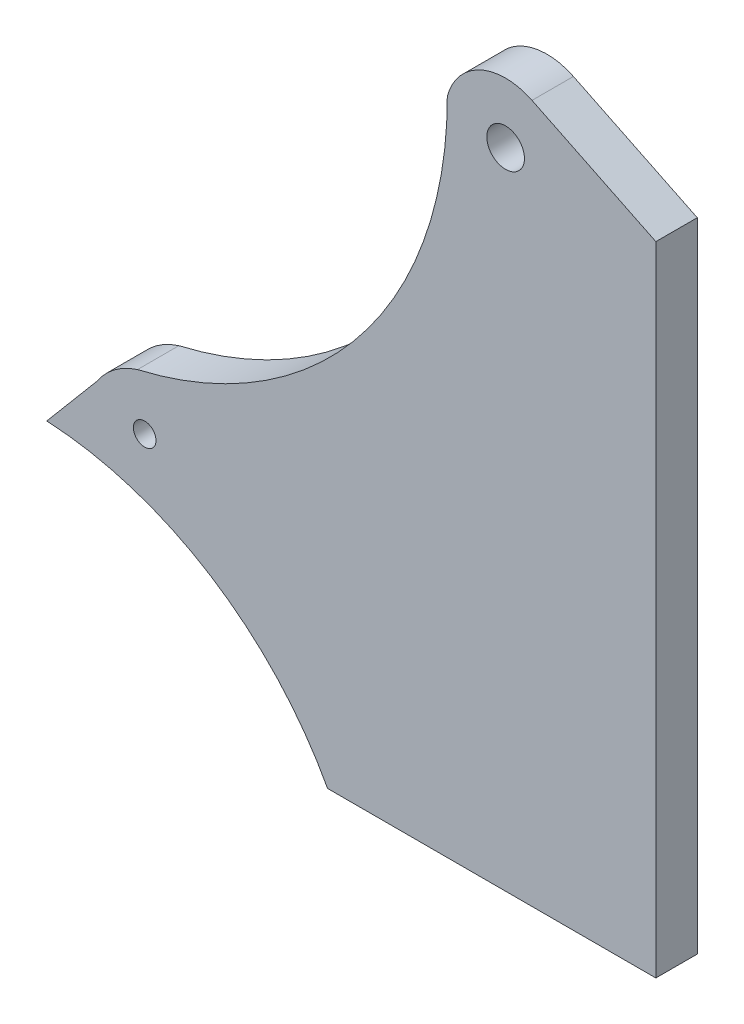
ISO-10303-21;
HEADER;
FILE_DESCRIPTION(('STEP AP214'),'2;1');
FILE_NAME('part.step','',(''),(''),'','','');
FILE_SCHEMA(('AUTOMOTIVE_DESIGN { 1 0 10303 214 1 1 1 1 }'));
ENDSEC;
DATA;
#1=APPLICATION_CONTEXT('core data for automotive mechanical design processes');
#2=APPLICATION_PROTOCOL_DEFINITION('international standard','automotive_design',2000,#1);
#3=PRODUCT_CONTEXT('',#1,'mechanical');
#4=PRODUCT('Part','Part','',(#3));
#5=PRODUCT_RELATED_PRODUCT_CATEGORY('part','',(#4));
#6=PRODUCT_DEFINITION_FORMATION('','',#4);
#7=PRODUCT_DEFINITION_CONTEXT('part definition',#1,'design');
#8=PRODUCT_DEFINITION('design','',#6,#7);
#9=PRODUCT_DEFINITION_SHAPE('','',#8);
#10=(LENGTH_UNIT() NAMED_UNIT(*) SI_UNIT(.MILLI.,.METRE.));
#11=(NAMED_UNIT(*) PLANE_ANGLE_UNIT() SI_UNIT($,.RADIAN.));
#12=(NAMED_UNIT(*) SI_UNIT($,.STERADIAN.) SOLID_ANGLE_UNIT());
#13=UNCERTAINTY_MEASURE_WITH_UNIT(LENGTH_MEASURE(1.E-05),#10,'distance_accuracy_value','');
#14=(GEOMETRIC_REPRESENTATION_CONTEXT(3) GLOBAL_UNCERTAINTY_ASSIGNED_CONTEXT((#13)) GLOBAL_UNIT_ASSIGNED_CONTEXT((#10,
#11,#12)) REPRESENTATION_CONTEXT('',''));
#15=CARTESIAN_POINT('',(0.,0.,0.));
#16=DIRECTION('',(0.,0.,1.));
#17=DIRECTION('',(1.,0.,0.));
#18=AXIS2_PLACEMENT_3D('',#15,#16,#17);
#19=CARTESIAN_POINT('',(-396.300392488017,-213.180671998761,55.));
#20=DIRECTION('',(0.,0.,-1.));
#21=DIRECTION('',(-1.,0.,0.));
#22=AXIS2_PLACEMENT_3D('',#19,#20,#21);
#23=PLANE('',#22);
#24=CARTESIAN_POINT('',(-396.300392488017,-213.180671998761,55.));
#25=DIRECTION('',(0.,0.,-1.));
#26=DIRECTION('',(-1.,0.,0.));
#27=AXIS2_PLACEMENT_3D('',#24,#25,#26);
#28=CIRCLE('',#27,450.);
#29=CARTESIAN_POINT('',(-372.9877043732,236.215054029937,55.));
#30=VERTEX_POINT('',#29);
#31=CARTESIAN_POINT('',(0.,0.,55.));
#32=VERTEX_POINT('',#31);
#33=EDGE_CURVE('E170',#30,#32,#28,.T.);
#34=ORIENTED_EDGE('',*,*,#33,.T.);
#35=DIRECTION('',(1.,0.,0.));
#36=VECTOR('',#35,1.);
#37=CARTESIAN_POINT('',(0.,0.,55.));
#38=LINE('',#37,#36);
#39=CARTESIAN_POINT('',(436.,0.,55.));
#40=VERTEX_POINT('',#39);
#41=EDGE_CURVE('E106',#32,#40,#38,.T.);
#42=ORIENTED_EDGE('',*,*,#41,.T.);
#43=DIRECTION('',(0.,1.,0.));
#44=VECTOR('',#43,1.);
#45=CARTESIAN_POINT('',(436.,0.,55.));
#46=LINE('',#45,#44);
#47=CARTESIAN_POINT('',(436.,847.,55.));
#48=VERTEX_POINT('',#47);
#49=EDGE_CURVE('E191',#40,#48,#46,.T.);
#50=ORIENTED_EDGE('',*,*,#49,.T.);
#51=DIRECTION('',(-0.898794046299168,0.438371146789075,0.));
#52=VECTOR('',#51,1.);
#53=CARTESIAN_POINT('',(436.,847.,55.));
#54=LINE('',#53,#52);
#55=CARTESIAN_POINT('',(271.520689527252,927.221919862401,55.));
#56=VERTEX_POINT('',#55);
#57=EDGE_CURVE('E205',#48,#56,#54,.T.);
#58=ORIENTED_EDGE('',*,*,#57,.T.);
#59=CARTESIAN_POINT('',(236.450997784126,855.318396158467,55.));
#60=DIRECTION('',(0.,0.,1.));
#61=DIRECTION('',(1.,0.,0.));
#62=AXIS2_PLACEMENT_3D('',#59,#60,#61);
#63=CIRCLE('',#62,80.);
#64=CARTESIAN_POINT('',(159.009788885328,875.389747988693,55.));
#65=VERTEX_POINT('',#64);
#66=EDGE_CURVE('E125',#56,#65,#63,.T.);
#67=ORIENTED_EDGE('',*,*,#66,.T.);
#68=CARTESIAN_POINT('',(-372.9877043732,873.756601748261,55.));
#69=DIRECTION('',(0.,0.,-1.));
#70=DIRECTION('',(-1.,0.,0.));
#71=AXIS2_PLACEMENT_3D('',#68,#69,#70);
#72=CIRCLE('',#71,532.);
#73=CARTESIAN_POINT('',(-252.456286899455,355.590433997249,55.));
#74=VERTEX_POINT('',#73);
#75=EDGE_CURVE('E119',#65,#74,#72,.T.);
#76=ORIENTED_EDGE('',*,*,#75,.T.);
#77=CARTESIAN_POINT('',(-223.06721379311,260.006531681274,55.));
#78=DIRECTION('',(0.,0.,1.));
#79=DIRECTION('',(1.,0.,0.));
#80=AXIS2_PLACEMENT_3D('',#77,#78,#79);
#81=CIRCLE('',#80,100.);
#82=CARTESIAN_POINT('',(-306.768623816851,314.724663594175,55.));
#83=VERTEX_POINT('',#82);
#84=EDGE_CURVE('E123',#74,#83,#81,.T.);
#85=ORIENTED_EDGE('',*,*,#84,.T.);
#86=DIRECTION('',(-0.644737828666312,-0.764403775688379,0.));
#87=VECTOR('',#86,1.);
#88=CARTESIAN_POINT('',(-306.768623816851,314.724663594175,55.));
#89=LINE('',#88,#87);
#90=EDGE_CURVE('E63',#83,#30,#89,.T.);
#91=ORIENTED_EDGE('',*,*,#90,.T.);
#92=EDGE_LOOP('',(#34,#42,#50,#58,#67,#76,#85,#91));
#93=FACE_BOUND('',#92,.T.);
#94=CARTESIAN_POINT('',(236.450997784126,855.318396158467,55.));
#95=DIRECTION('',(0.,0.,1.));
#96=DIRECTION('',(1.,0.,0.));
#97=AXIS2_PLACEMENT_3D('',#94,#95,#96);
#98=CIRCLE('',#97,25.);
#99=CARTESIAN_POINT('',(261.450997784126,855.318396158467,55.));
#100=VERTEX_POINT('',#99);
#101=EDGE_CURVE('E152',#100,#100,#98,.T.);
#102=ORIENTED_EDGE('',*,*,#101,.F.);
#103=EDGE_LOOP('',(#102));
#104=FACE_BOUND('',#103,.T.);
#105=CARTESIAN_POINT('',(-242.894848686502,286.215054029937,55.));
#106=DIRECTION('',(0.,0.,1.));
#107=DIRECTION('',(1.,0.,0.));
#108=AXIS2_PLACEMENT_3D('',#105,#106,#107);
#109=CIRCLE('',#108,15.0000000000001);
#110=CARTESIAN_POINT('',(-227.894848686502,286.215054029937,55.));
#111=VERTEX_POINT('',#110);
#112=EDGE_CURVE('E219',#111,#111,#109,.T.);
#113=ORIENTED_EDGE('',*,*,#112,.F.);
#114=EDGE_LOOP('',(#113));
#115=FACE_BOUND('',#114,.T.);
#116=ADVANCED_FACE('F45',(#93,#104,#115),#23,.F.);
#117=CARTESIAN_POINT('',(-396.300392488017,-213.180671998761,0.));
#118=DIRECTION('',(0.,0.,-1.));
#119=DIRECTION('',(-1.,0.,0.));
#120=AXIS2_PLACEMENT_3D('',#117,#118,#119);
#121=PLANE('',#120);
#122=CARTESIAN_POINT('',(236.450997784126,855.318396158467,0.));
#123=DIRECTION('',(0.,0.,1.));
#124=DIRECTION('',(1.,0.,0.));
#125=AXIS2_PLACEMENT_3D('',#122,#123,#124);
#126=CIRCLE('',#125,25.);
#127=CARTESIAN_POINT('',(261.450997784126,855.318396158467,0.));
#128=VERTEX_POINT('',#127);
#129=EDGE_CURVE('E215',#128,#128,#126,.T.);
#130=ORIENTED_EDGE('',*,*,#129,.T.);
#131=EDGE_LOOP('',(#130));
#132=FACE_BOUND('',#131,.T.);
#133=CARTESIAN_POINT('',(-396.300392488017,-213.180671998761,0.));
#134=DIRECTION('',(0.,0.,-1.));
#135=DIRECTION('',(-1.,0.,0.));
#136=AXIS2_PLACEMENT_3D('',#133,#134,#135);
#137=CIRCLE('',#136,450.);
#138=CARTESIAN_POINT('',(-372.9877043732,236.215054029937,0.));
#139=VERTEX_POINT('',#138);
#140=CARTESIAN_POINT('',(0.,0.,0.));
#141=VERTEX_POINT('',#140);
#142=EDGE_CURVE('E147',#139,#141,#137,.T.);
#143=ORIENTED_EDGE('',*,*,#142,.F.);
#144=DIRECTION('',(-0.644737828666312,-0.764403775688379,0.));
#145=VECTOR('',#144,1.);
#146=CARTESIAN_POINT('',(-306.768623816851,314.724663594175,0.));
#147=LINE('',#146,#145);
#148=CARTESIAN_POINT('',(-306.768623816851,314.724663594175,0.));
#149=VERTEX_POINT('',#148);
#150=EDGE_CURVE('E98',#149,#139,#147,.T.);
#151=ORIENTED_EDGE('',*,*,#150,.F.);
#152=CARTESIAN_POINT('',(-223.06721379311,260.006531681274,0.));
#153=DIRECTION('',(0.,0.,1.));
#154=DIRECTION('',(1.,0.,0.));
#155=AXIS2_PLACEMENT_3D('',#152,#153,#154);
#156=CIRCLE('',#155,100.);
#157=CARTESIAN_POINT('',(-252.456286899455,355.590433997249,0.));
#158=VERTEX_POINT('',#157);
#159=EDGE_CURVE('E92',#158,#149,#156,.T.);
#160=ORIENTED_EDGE('',*,*,#159,.F.);
#161=CARTESIAN_POINT('',(-372.9877043732,873.756601748261,0.));
#162=DIRECTION('',(0.,0.,-1.));
#163=DIRECTION('',(-1.,0.,0.));
#164=AXIS2_PLACEMENT_3D('',#161,#162,#163);
#165=CIRCLE('',#164,532.);
#166=CARTESIAN_POINT('',(159.009788885328,875.389747988693,0.));
#167=VERTEX_POINT('',#166);
#168=EDGE_CURVE('E134',#167,#158,#165,.T.);
#169=ORIENTED_EDGE('',*,*,#168,.F.);
#170=CARTESIAN_POINT('',(236.450997784126,855.318396158467,0.));
#171=DIRECTION('',(0.,0.,1.));
#172=DIRECTION('',(1.,0.,0.));
#173=AXIS2_PLACEMENT_3D('',#170,#171,#172);
#174=CIRCLE('',#173,80.);
#175=CARTESIAN_POINT('',(271.520689527252,927.221919862401,0.));
#176=VERTEX_POINT('',#175);
#177=EDGE_CURVE('E161',#176,#167,#174,.T.);
#178=ORIENTED_EDGE('',*,*,#177,.F.);
#179=DIRECTION('',(-0.898794046299168,0.438371146789075,0.));
#180=VECTOR('',#179,1.);
#181=CARTESIAN_POINT('',(436.,847.,0.));
#182=LINE('',#181,#180);
#183=CARTESIAN_POINT('',(436.,847.,0.));
#184=VERTEX_POINT('',#183);
#185=EDGE_CURVE('E158',#184,#176,#182,.T.);
#186=ORIENTED_EDGE('',*,*,#185,.F.);
#187=DIRECTION('',(0.,1.,0.));
#188=VECTOR('',#187,1.);
#189=CARTESIAN_POINT('',(436.,0.,0.));
#190=LINE('',#189,#188);
#191=CARTESIAN_POINT('',(436.,0.,0.));
#192=VERTEX_POINT('',#191);
#193=EDGE_CURVE('E155',#192,#184,#190,.T.);
#194=ORIENTED_EDGE('',*,*,#193,.F.);
#195=DIRECTION('',(1.,0.,0.));
#196=VECTOR('',#195,1.);
#197=CARTESIAN_POINT('',(0.,0.,0.));
#198=LINE('',#197,#196);
#199=EDGE_CURVE('E151',#141,#192,#198,.T.);
#200=ORIENTED_EDGE('',*,*,#199,.F.);
#201=EDGE_LOOP('',(#143,#151,#160,#169,#178,#186,#194,#200));
#202=FACE_BOUND('',#201,.T.);
#203=CARTESIAN_POINT('',(-242.894848686502,286.215054029937,0.));
#204=DIRECTION('',(0.,0.,1.));
#205=DIRECTION('',(1.,0.,0.));
#206=AXIS2_PLACEMENT_3D('',#203,#204,#205);
#207=CIRCLE('',#206,15.0000000000001);
#208=CARTESIAN_POINT('',(-227.894848686502,286.215054029937,0.));
#209=VERTEX_POINT('',#208);
#210=EDGE_CURVE('E223',#209,#209,#207,.T.);
#211=ORIENTED_EDGE('',*,*,#210,.T.);
#212=EDGE_LOOP('',(#211));
#213=FACE_BOUND('',#212,.T.);
#214=ADVANCED_FACE('F195',(#132,#202,#213),#121,.T.);
#215=CARTESIAN_POINT('',(-396.300392488017,-213.180671998761,55.));
#216=DIRECTION('',(0.,0.,-1.));
#217=DIRECTION('',(-1.,0.,0.));
#218=AXIS2_PLACEMENT_3D('',#215,#216,#217);
#219=CYLINDRICAL_SURFACE('',#218,450.);
#220=ORIENTED_EDGE('',*,*,#142,.T.);
#221=DIRECTION('',(0.,0.,-1.));
#222=VECTOR('',#221,1.);
#223=CARTESIAN_POINT('',(0.,0.,55.));
#224=LINE('',#223,#222);
#225=EDGE_CURVE('E11',#32,#141,#224,.T.);
#226=ORIENTED_EDGE('',*,*,#225,.F.);
#227=ORIENTED_EDGE('',*,*,#33,.F.);
#228=DIRECTION('',(0.,0.,-1.));
#229=VECTOR('',#228,1.);
#230=CARTESIAN_POINT('',(-372.9877043732,236.215054029937,55.));
#231=LINE('',#230,#229);
#232=EDGE_CURVE('E143',#30,#139,#231,.T.);
#233=ORIENTED_EDGE('',*,*,#232,.T.);
#234=EDGE_LOOP('',(#220,#226,#227,#233));
#235=FACE_BOUND('',#234,.T.);
#236=ADVANCED_FACE('F47',(#235),#219,.F.);
#237=CARTESIAN_POINT('',(0.,0.,55.));
#238=DIRECTION('',(0.,1.,0.));
#239=DIRECTION('',(0.,0.,1.));
#240=AXIS2_PLACEMENT_3D('',#237,#238,#239);
#241=PLANE('',#240);
#242=ORIENTED_EDGE('',*,*,#199,.T.);
#243=DIRECTION('',(0.,0.,-1.));
#244=VECTOR('',#243,1.);
#245=CARTESIAN_POINT('',(436.,0.,55.));
#246=LINE('',#245,#244);
#247=EDGE_CURVE('E55',#40,#192,#246,.T.);
#248=ORIENTED_EDGE('',*,*,#247,.F.);
#249=ORIENTED_EDGE('',*,*,#41,.F.);
#250=ORIENTED_EDGE('',*,*,#225,.T.);
#251=EDGE_LOOP('',(#242,#248,#249,#250));
#252=FACE_BOUND('',#251,.T.);
#253=ADVANCED_FACE('F257',(#252),#241,.F.);
#254=CARTESIAN_POINT('',(436.,0.,55.));
#255=DIRECTION('',(-1.,0.,0.));
#256=DIRECTION('',(0.,0.,1.));
#257=AXIS2_PLACEMENT_3D('',#254,#255,#256);
#258=PLANE('',#257);
#259=ORIENTED_EDGE('',*,*,#193,.T.);
#260=DIRECTION('',(0.,0.,-1.));
#261=VECTOR('',#260,1.);
#262=CARTESIAN_POINT('',(436.,847.,55.));
#263=LINE('',#262,#261);
#264=EDGE_CURVE('E181',#48,#184,#263,.T.);
#265=ORIENTED_EDGE('',*,*,#264,.F.);
#266=ORIENTED_EDGE('',*,*,#49,.F.);
#267=ORIENTED_EDGE('',*,*,#247,.T.);
#268=EDGE_LOOP('',(#259,#265,#266,#267));
#269=FACE_BOUND('',#268,.T.);
#270=ADVANCED_FACE('F189',(#269),#258,.F.);
#271=CARTESIAN_POINT('',(436.,847.,55.));
#272=DIRECTION('',(-0.438371146789075,-0.898794046299168,0.));
#273=DIRECTION('',(0.898794046299168,-0.438371146789075,0.));
#274=AXIS2_PLACEMENT_3D('',#271,#272,#273);
#275=PLANE('',#274);
#276=ORIENTED_EDGE('',*,*,#185,.T.);
#277=DIRECTION('',(0.,0.,-1.));
#278=VECTOR('',#277,1.);
#279=CARTESIAN_POINT('',(271.520689527252,927.221919862401,55.));
#280=LINE('',#279,#278);
#281=EDGE_CURVE('E177',#56,#176,#280,.T.);
#282=ORIENTED_EDGE('',*,*,#281,.F.);
#283=ORIENTED_EDGE('',*,*,#57,.F.);
#284=ORIENTED_EDGE('',*,*,#264,.T.);
#285=EDGE_LOOP('',(#276,#282,#283,#284));
#286=FACE_BOUND('',#285,.T.);
#287=ADVANCED_FACE('F200',(#286),#275,.F.);
#288=CARTESIAN_POINT('',(236.450997784126,855.318396158467,55.));
#289=DIRECTION('',(0.,0.,-1.));
#290=DIRECTION('',(-1.,0.,0.));
#291=AXIS2_PLACEMENT_3D('',#288,#289,#290);
#292=CYLINDRICAL_SURFACE('',#291,80.);
#293=ORIENTED_EDGE('',*,*,#177,.T.);
#294=DIRECTION('',(0.,0.,-1.));
#295=VECTOR('',#294,1.);
#296=CARTESIAN_POINT('',(159.009788885328,875.389747988693,55.));
#297=LINE('',#296,#295);
#298=EDGE_CURVE('E136',#65,#167,#297,.T.);
#299=ORIENTED_EDGE('',*,*,#298,.F.);
#300=ORIENTED_EDGE('',*,*,#66,.F.);
#301=ORIENTED_EDGE('',*,*,#281,.T.);
#302=EDGE_LOOP('',(#293,#299,#300,#301));
#303=FACE_BOUND('',#302,.T.);
#304=ADVANCED_FACE('F203',(#303),#292,.T.);
#305=CARTESIAN_POINT('',(-372.9877043732,873.756601748261,55.));
#306=DIRECTION('',(0.,0.,-1.));
#307=DIRECTION('',(-1.,0.,0.));
#308=AXIS2_PLACEMENT_3D('',#305,#306,#307);
#309=CYLINDRICAL_SURFACE('',#308,532.);
#310=ORIENTED_EDGE('',*,*,#168,.T.);
#311=DIRECTION('',(0.,0.,-1.));
#312=VECTOR('',#311,1.);
#313=CARTESIAN_POINT('',(-252.456286899455,355.590433997249,55.));
#314=LINE('',#313,#312);
#315=EDGE_CURVE('E131',#74,#158,#314,.T.);
#316=ORIENTED_EDGE('',*,*,#315,.F.);
#317=ORIENTED_EDGE('',*,*,#75,.F.);
#318=ORIENTED_EDGE('',*,*,#298,.T.);
#319=EDGE_LOOP('',(#310,#316,#317,#318));
#320=FACE_BOUND('',#319,.T.);
#321=ADVANCED_FACE('F132',(#320),#309,.F.);
#322=CARTESIAN_POINT('',(-223.06721379311,260.006531681274,55.));
#323=DIRECTION('',(0.,0.,-1.));
#324=DIRECTION('',(-1.,0.,0.));
#325=AXIS2_PLACEMENT_3D('',#322,#323,#324);
#326=CYLINDRICAL_SURFACE('',#325,100.);
#327=ORIENTED_EDGE('',*,*,#159,.T.);
#328=DIRECTION('',(0.,0.,-1.));
#329=VECTOR('',#328,1.);
#330=CARTESIAN_POINT('',(-306.768623816851,314.724663594175,55.));
#331=LINE('',#330,#329);
#332=EDGE_CURVE('E137',#83,#149,#331,.T.);
#333=ORIENTED_EDGE('',*,*,#332,.F.);
#334=ORIENTED_EDGE('',*,*,#84,.F.);
#335=ORIENTED_EDGE('',*,*,#315,.T.);
#336=EDGE_LOOP('',(#327,#333,#334,#335));
#337=FACE_BOUND('',#336,.T.);
#338=ADVANCED_FACE('F139',(#337),#326,.T.);
#339=CARTESIAN_POINT('',(-306.768623816851,314.724663594175,55.));
#340=DIRECTION('',(0.764403775688379,-0.644737828666312,0.));
#341=DIRECTION('',(0.644737828666312,0.764403775688379,0.));
#342=AXIS2_PLACEMENT_3D('',#339,#340,#341);
#343=PLANE('',#342);
#344=ORIENTED_EDGE('',*,*,#150,.T.);
#345=ORIENTED_EDGE('',*,*,#232,.F.);
#346=ORIENTED_EDGE('',*,*,#90,.F.);
#347=ORIENTED_EDGE('',*,*,#332,.T.);
#348=EDGE_LOOP('',(#344,#345,#346,#347));
#349=FACE_BOUND('',#348,.T.);
#350=ADVANCED_FACE('F245',(#349),#343,.F.);
#351=CARTESIAN_POINT('',(236.450997784126,855.318396158467,55.));
#352=DIRECTION('',(0.,0.,-1.));
#353=DIRECTION('',(-1.,0.,0.));
#354=AXIS2_PLACEMENT_3D('',#351,#352,#353);
#355=CYLINDRICAL_SURFACE('',#354,25.);
#356=ORIENTED_EDGE('',*,*,#101,.T.);
#357=EDGE_LOOP('',(#356));
#358=FACE_BOUND('',#357,.T.);
#359=ORIENTED_EDGE('',*,*,#129,.F.);
#360=EDGE_LOOP('',(#359));
#361=FACE_BOUND('',#360,.T.);
#362=ADVANCED_FACE('F242',(#358,#361),#355,.F.);
#363=CARTESIAN_POINT('',(-242.894848686502,286.215054029937,55.));
#364=DIRECTION('',(0.,0.,-1.));
#365=DIRECTION('',(-1.,0.,0.));
#366=AXIS2_PLACEMENT_3D('',#363,#364,#365);
#367=CYLINDRICAL_SURFACE('',#366,15.0000000000001);
#368=ORIENTED_EDGE('',*,*,#112,.T.);
#369=EDGE_LOOP('',(#368));
#370=FACE_BOUND('',#369,.T.);
#371=ORIENTED_EDGE('',*,*,#210,.F.);
#372=EDGE_LOOP('',(#371));
#373=FACE_BOUND('',#372,.T.);
#374=ADVANCED_FACE('F231',(#370,#373),#367,.F.);
#375=CLOSED_SHELL('',(#116,#214,#236,#253,#270,#287,#304,#321,#338,#350,#362,#374));
#376=MANIFOLD_SOLID_BREP('B2',#375);
#377=ADVANCED_BREP_SHAPE_REPRESENTATION('',(#18,#376),#14);
#378=SHAPE_DEFINITION_REPRESENTATION(#9,#377);
ENDSEC;
END-ISO-10303-21;
